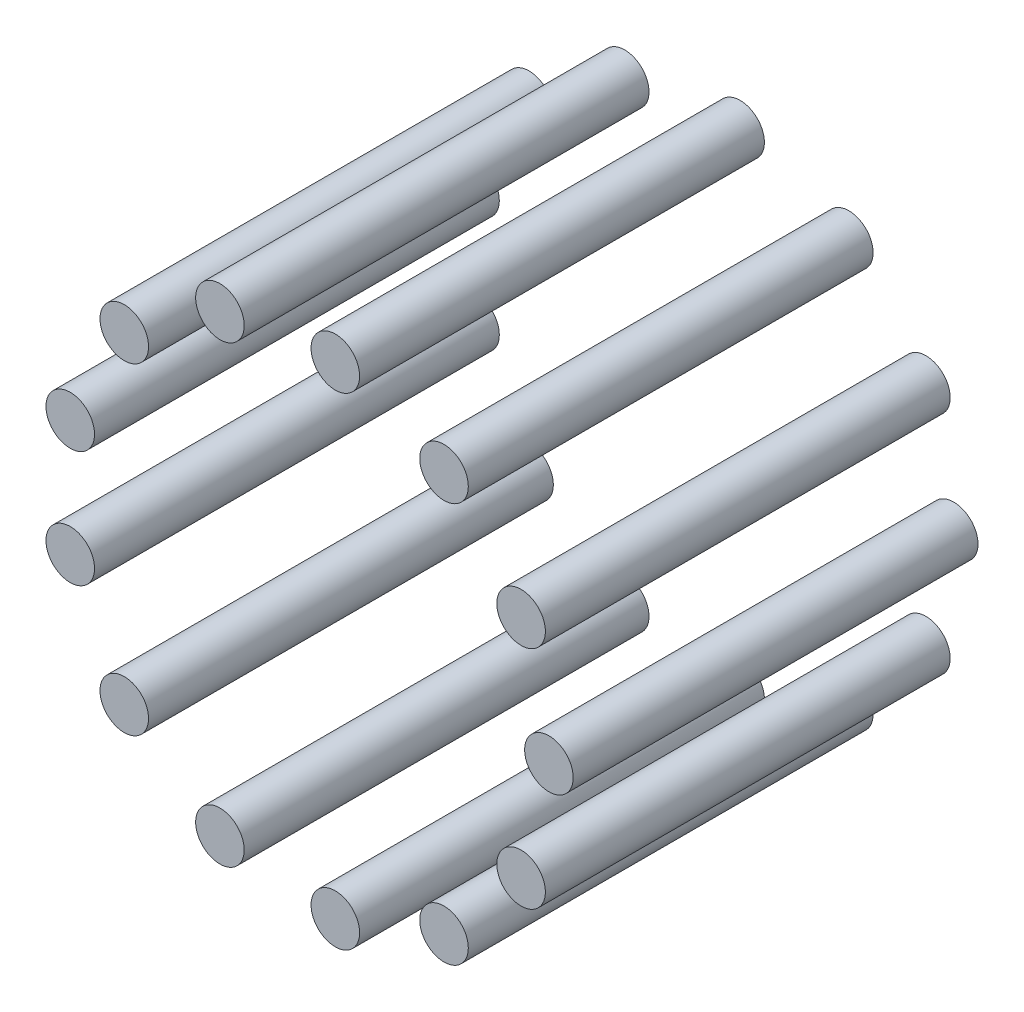
ISO-10303-21;
HEADER;
FILE_DESCRIPTION(('STEP AP214'),'2;1');
FILE_NAME('part.step','',(''),(''),'','','');
FILE_SCHEMA(('AUTOMOTIVE_DESIGN { 1 0 10303 214 1 1 1 1 }'));
ENDSEC;
DATA;
#1=APPLICATION_CONTEXT('core data for automotive mechanical design processes');
#2=APPLICATION_PROTOCOL_DEFINITION('international standard','automotive_design',2000,#1);
#3=PRODUCT_CONTEXT('',#1,'mechanical');
#4=PRODUCT('Part','Part','',(#3));
#5=PRODUCT_RELATED_PRODUCT_CATEGORY('part','',(#4));
#6=PRODUCT_DEFINITION_FORMATION('','',#4);
#7=PRODUCT_DEFINITION_CONTEXT('part definition',#1,'design');
#8=PRODUCT_DEFINITION('design','',#6,#7);
#9=PRODUCT_DEFINITION_SHAPE('','',#8);
#10=(LENGTH_UNIT() NAMED_UNIT(*) SI_UNIT(.MILLI.,.METRE.));
#11=(NAMED_UNIT(*) PLANE_ANGLE_UNIT() SI_UNIT($,.RADIAN.));
#12=(NAMED_UNIT(*) SI_UNIT($,.STERADIAN.) SOLID_ANGLE_UNIT());
#13=UNCERTAINTY_MEASURE_WITH_UNIT(LENGTH_MEASURE(1.E-05),#10,'distance_accuracy_value','');
#14=(GEOMETRIC_REPRESENTATION_CONTEXT(3) GLOBAL_UNCERTAINTY_ASSIGNED_CONTEXT((#13)) GLOBAL_UNIT_ASSIGNED_CONTEXT((#10,
#11,#12)) REPRESENTATION_CONTEXT('',''));
#15=CARTESIAN_POINT('',(0.,0.,0.));
#16=DIRECTION('',(0.,0.,1.));
#17=DIRECTION('',(1.,0.,0.));
#18=AXIS2_PLACEMENT_3D('',#15,#16,#17);
#19=CARTESIAN_POINT('',(26.5636807695963,13.9416951613131,50.));
#20=DIRECTION('',(0.,0.,-1.));
#21=DIRECTION('',(-1.,0.,0.));
#22=AXIS2_PLACEMENT_3D('',#19,#20,#21);
#23=CYLINDRICAL_SURFACE('',#22,3.);
#24=CARTESIAN_POINT('',(26.5636807695963,13.9416951613131,50.));
#25=DIRECTION('',(0.,0.,1.));
#26=DIRECTION('',(1.,0.,0.));
#27=AXIS2_PLACEMENT_3D('',#24,#25,#26);
#28=CIRCLE('',#27,3.);
#29=CARTESIAN_POINT('',(29.5636807695963,13.9416951613131,50.));
#30=VERTEX_POINT('',#29);
#31=EDGE_CURVE('E56',#30,#30,#28,.T.);
#32=ORIENTED_EDGE('',*,*,#31,.F.);
#33=EDGE_LOOP('',(#32));
#34=FACE_BOUND('',#33,.T.);
#35=CARTESIAN_POINT('',(26.5636807695963,13.9416951613131,0.));
#36=DIRECTION('',(0.,0.,1.));
#37=DIRECTION('',(1.,0.,0.));
#38=AXIS2_PLACEMENT_3D('',#35,#36,#37);
#39=CIRCLE('',#38,3.);
#40=CARTESIAN_POINT('',(29.5636807695963,13.9416951613131,0.));
#41=VERTEX_POINT('',#40);
#42=EDGE_CURVE('E11',#41,#41,#39,.T.);
#43=ORIENTED_EDGE('',*,*,#42,.T.);
#44=EDGE_LOOP('',(#43));
#45=FACE_BOUND('',#44,.T.);
#46=ADVANCED_FACE('F52',(#34,#45),#23,.T.);
#47=CARTESIAN_POINT('',(26.5636807695963,13.9416951613131,50.));
#48=DIRECTION('',(0.,0.,1.));
#49=DIRECTION('',(1.,0.,0.));
#50=AXIS2_PLACEMENT_3D('',#47,#48,#49);
#51=PLANE('',#50);
#52=ORIENTED_EDGE('',*,*,#31,.T.);
#53=EDGE_LOOP('',(#52));
#54=FACE_BOUND('',#53,.T.);
#55=ADVANCED_FACE('F54',(#54),#51,.T.);
#56=CARTESIAN_POINT('',(26.5636807695963,13.9416951613131,0.));
#57=DIRECTION('',(0.,0.,1.));
#58=DIRECTION('',(1.,0.,0.));
#59=AXIS2_PLACEMENT_3D('',#56,#57,#58);
#60=PLANE('',#59);
#61=ORIENTED_EDGE('',*,*,#42,.F.);
#62=EDGE_LOOP('',(#61));
#63=FACE_BOUND('',#62,.T.);
#64=ADVANCED_FACE('F71',(#63),#60,.F.);
#65=CLOSED_SHELL('',(#46,#55,#64));
#66=MANIFOLD_SOLID_BREP('B2',#65);
#67=CARTESIAN_POINT('',(17.0419424019347,24.6895159768097,50.));
#68=DIRECTION('',(0.,0.,-1.));
#69=DIRECTION('',(-1.,0.,0.));
#70=AXIS2_PLACEMENT_3D('',#67,#68,#69);
#71=CYLINDRICAL_SURFACE('',#70,3.);
#72=CARTESIAN_POINT('',(17.0419424019347,24.6895159768097,50.));
#73=DIRECTION('',(0.,0.,1.));
#74=DIRECTION('',(1.,0.,0.));
#75=AXIS2_PLACEMENT_3D('',#72,#73,#74);
#76=CIRCLE('',#75,3.);
#77=CARTESIAN_POINT('',(20.0419424019347,24.6895159768097,50.));
#78=VERTEX_POINT('',#77);
#79=EDGE_CURVE('E105',#78,#78,#76,.T.);
#80=ORIENTED_EDGE('',*,*,#79,.F.);
#81=EDGE_LOOP('',(#80));
#82=FACE_BOUND('',#81,.T.);
#83=CARTESIAN_POINT('',(17.0419424019347,24.6895159768097,0.));
#84=DIRECTION('',(0.,0.,1.));
#85=DIRECTION('',(1.,0.,0.));
#86=AXIS2_PLACEMENT_3D('',#83,#84,#85);
#87=CIRCLE('',#86,3.);
#88=CARTESIAN_POINT('',(20.0419424019347,24.6895159768097,0.));
#89=VERTEX_POINT('',#88);
#90=EDGE_CURVE('E51',#89,#89,#87,.T.);
#91=ORIENTED_EDGE('',*,*,#90,.T.);
#92=EDGE_LOOP('',(#91));
#93=FACE_BOUND('',#92,.T.);
#94=ADVANCED_FACE('F101',(#82,#93),#71,.T.);
#95=CARTESIAN_POINT('',(17.0419424019347,24.6895159768097,50.));
#96=DIRECTION('',(0.,0.,1.));
#97=DIRECTION('',(1.,0.,0.));
#98=AXIS2_PLACEMENT_3D('',#95,#96,#97);
#99=PLANE('',#98);
#100=ORIENTED_EDGE('',*,*,#79,.T.);
#101=EDGE_LOOP('',(#100));
#102=FACE_BOUND('',#101,.T.);
#103=ADVANCED_FACE('F103',(#102),#99,.T.);
#104=CARTESIAN_POINT('',(17.0419424019347,24.6895159768097,0.));
#105=DIRECTION('',(0.,0.,1.));
#106=DIRECTION('',(1.,0.,0.));
#107=AXIS2_PLACEMENT_3D('',#104,#105,#106);
#108=PLANE('',#107);
#109=ORIENTED_EDGE('',*,*,#90,.F.);
#110=EDGE_LOOP('',(#109));
#111=FACE_BOUND('',#110,.T.);
#112=ADVANCED_FACE('F120',(#111),#108,.F.);
#113=CLOSED_SHELL('',(#94,#103,#112));
#114=MANIFOLD_SOLID_BREP('B6',#113);
#115=CARTESIAN_POINT('',(3.61610040765973,29.7812662229416,50.));
#116=DIRECTION('',(0.,0.,-1.));
#117=DIRECTION('',(-1.,0.,0.));
#118=AXIS2_PLACEMENT_3D('',#115,#116,#117);
#119=CYLINDRICAL_SURFACE('',#118,3.);
#120=CARTESIAN_POINT('',(3.61610040765973,29.7812662229416,50.));
#121=DIRECTION('',(0.,0.,1.));
#122=DIRECTION('',(1.,0.,0.));
#123=AXIS2_PLACEMENT_3D('',#120,#121,#122);
#124=CIRCLE('',#123,3.);
#125=CARTESIAN_POINT('',(6.61610040765973,29.7812662229416,50.));
#126=VERTEX_POINT('',#125);
#127=EDGE_CURVE('E154',#126,#126,#124,.T.);
#128=ORIENTED_EDGE('',*,*,#127,.F.);
#129=EDGE_LOOP('',(#128));
#130=FACE_BOUND('',#129,.T.);
#131=CARTESIAN_POINT('',(3.61610040765973,29.7812662229416,0.));
#132=DIRECTION('',(0.,0.,1.));
#133=DIRECTION('',(1.,0.,0.));
#134=AXIS2_PLACEMENT_3D('',#131,#132,#133);
#135=CIRCLE('',#134,3.);
#136=CARTESIAN_POINT('',(6.61610040765973,29.7812662229416,0.));
#137=VERTEX_POINT('',#136);
#138=EDGE_CURVE('E100',#137,#137,#135,.T.);
#139=ORIENTED_EDGE('',*,*,#138,.T.);
#140=EDGE_LOOP('',(#139));
#141=FACE_BOUND('',#140,.T.);
#142=ADVANCED_FACE('F150',(#130,#141),#119,.T.);
#143=CARTESIAN_POINT('',(3.61610040765973,29.7812662229416,50.));
#144=DIRECTION('',(0.,0.,1.));
#145=DIRECTION('',(1.,0.,0.));
#146=AXIS2_PLACEMENT_3D('',#143,#144,#145);
#147=PLANE('',#146);
#148=ORIENTED_EDGE('',*,*,#127,.T.);
#149=EDGE_LOOP('',(#148));
#150=FACE_BOUND('',#149,.T.);
#151=ADVANCED_FACE('F152',(#150),#147,.T.);
#152=CARTESIAN_POINT('',(3.61610040765973,29.7812662229416,0.));
#153=DIRECTION('',(0.,0.,1.));
#154=DIRECTION('',(1.,0.,0.));
#155=AXIS2_PLACEMENT_3D('',#152,#153,#154);
#156=PLANE('',#155);
#157=ORIENTED_EDGE('',*,*,#138,.F.);
#158=EDGE_LOOP('',(#157));
#159=FACE_BOUND('',#158,.T.);
#160=ADVANCED_FACE('F169',(#159),#156,.F.);
#161=CLOSED_SHELL('',(#142,#151,#160));
#162=MANIFOLD_SOLID_BREP('B46',#161);
#163=CARTESIAN_POINT('',(-10.638146611276,28.0504872805624,50.));
#164=DIRECTION('',(0.,0.,-1.));
#165=DIRECTION('',(-1.,0.,0.));
#166=AXIS2_PLACEMENT_3D('',#163,#164,#165);
#167=CYLINDRICAL_SURFACE('',#166,3.);
#168=CARTESIAN_POINT('',(-10.638146611276,28.0504872805624,50.));
#169=DIRECTION('',(0.,0.,1.));
#170=DIRECTION('',(1.,0.,0.));
#171=AXIS2_PLACEMENT_3D('',#168,#169,#170);
#172=CIRCLE('',#171,3.);
#173=CARTESIAN_POINT('',(-7.638146611276,28.0504872805624,50.));
#174=VERTEX_POINT('',#173);
#175=EDGE_CURVE('E203',#174,#174,#172,.T.);
#176=ORIENTED_EDGE('',*,*,#175,.F.);
#177=EDGE_LOOP('',(#176));
#178=FACE_BOUND('',#177,.T.);
#179=CARTESIAN_POINT('',(-10.638146611276,28.0504872805624,0.));
#180=DIRECTION('',(0.,0.,1.));
#181=DIRECTION('',(1.,0.,0.));
#182=AXIS2_PLACEMENT_3D('',#179,#180,#181);
#183=CIRCLE('',#182,3.);
#184=CARTESIAN_POINT('',(-7.638146611276,28.0504872805624,0.));
#185=VERTEX_POINT('',#184);
#186=EDGE_CURVE('E149',#185,#185,#183,.T.);
#187=ORIENTED_EDGE('',*,*,#186,.T.);
#188=EDGE_LOOP('',(#187));
#189=FACE_BOUND('',#188,.T.);
#190=ADVANCED_FACE('F199',(#178,#189),#167,.T.);
#191=CARTESIAN_POINT('',(-10.638146611276,28.0504872805624,50.));
#192=DIRECTION('',(0.,0.,1.));
#193=DIRECTION('',(1.,0.,0.));
#194=AXIS2_PLACEMENT_3D('',#191,#192,#193);
#195=PLANE('',#194);
#196=ORIENTED_EDGE('',*,*,#175,.T.);
#197=EDGE_LOOP('',(#196));
#198=FACE_BOUND('',#197,.T.);
#199=ADVANCED_FACE('F201',(#198),#195,.T.);
#200=CARTESIAN_POINT('',(-10.638146611276,28.0504872805624,0.));
#201=DIRECTION('',(0.,0.,1.));
#202=DIRECTION('',(1.,0.,0.));
#203=AXIS2_PLACEMENT_3D('',#200,#201,#202);
#204=PLANE('',#203);
#205=ORIENTED_EDGE('',*,*,#186,.F.);
#206=EDGE_LOOP('',(#205));
#207=FACE_BOUND('',#206,.T.);
#208=ADVANCED_FACE('F218',(#207),#204,.F.);
#209=CLOSED_SHELL('',(#190,#199,#208));
#210=MANIFOLD_SOLID_BREP('B95',#209);
#211=CARTESIAN_POINT('',(-22.4553224451329,19.8936797472238,50.));
#212=DIRECTION('',(0.,0.,-1.));
#213=DIRECTION('',(-1.,0.,0.));
#214=AXIS2_PLACEMENT_3D('',#211,#212,#213);
#215=CYLINDRICAL_SURFACE('',#214,3.);
#216=CARTESIAN_POINT('',(-22.4553224451329,19.8936797472238,50.));
#217=DIRECTION('',(0.,0.,1.));
#218=DIRECTION('',(1.,0.,0.));
#219=AXIS2_PLACEMENT_3D('',#216,#217,#218);
#220=CIRCLE('',#219,3.);
#221=CARTESIAN_POINT('',(-19.4553224451329,19.8936797472238,50.));
#222=VERTEX_POINT('',#221);
#223=EDGE_CURVE('E252',#222,#222,#220,.T.);
#224=ORIENTED_EDGE('',*,*,#223,.F.);
#225=EDGE_LOOP('',(#224));
#226=FACE_BOUND('',#225,.T.);
#227=CARTESIAN_POINT('',(-22.4553224451329,19.8936797472238,0.));
#228=DIRECTION('',(0.,0.,1.));
#229=DIRECTION('',(1.,0.,0.));
#230=AXIS2_PLACEMENT_3D('',#227,#228,#229);
#231=CIRCLE('',#230,3.);
#232=CARTESIAN_POINT('',(-19.4553224451329,19.8936797472238,0.));
#233=VERTEX_POINT('',#232);
#234=EDGE_CURVE('E198',#233,#233,#231,.T.);
#235=ORIENTED_EDGE('',*,*,#234,.T.);
#236=EDGE_LOOP('',(#235));
#237=FACE_BOUND('',#236,.T.);
#238=ADVANCED_FACE('F248',(#226,#237),#215,.T.);
#239=CARTESIAN_POINT('',(-22.4553224451329,19.8936797472238,50.));
#240=DIRECTION('',(0.,0.,1.));
#241=DIRECTION('',(1.,0.,0.));
#242=AXIS2_PLACEMENT_3D('',#239,#240,#241);
#243=PLANE('',#242);
#244=ORIENTED_EDGE('',*,*,#223,.T.);
#245=EDGE_LOOP('',(#244));
#246=FACE_BOUND('',#245,.T.);
#247=ADVANCED_FACE('F250',(#246),#243,.T.);
#248=CARTESIAN_POINT('',(-22.4553224451329,19.8936797472238,0.));
#249=DIRECTION('',(0.,0.,1.));
#250=DIRECTION('',(1.,0.,0.));
#251=AXIS2_PLACEMENT_3D('',#248,#249,#250);
#252=PLANE('',#251);
#253=ORIENTED_EDGE('',*,*,#234,.F.);
#254=EDGE_LOOP('',(#253));
#255=FACE_BOUND('',#254,.T.);
#256=ADVANCED_FACE('F267',(#255),#252,.F.);
#257=CLOSED_SHELL('',(#238,#247,#256));
#258=MANIFOLD_SOLID_BREP('B144',#257);
#259=CARTESIAN_POINT('',(-29.1282545227815,7.17946992862675,50.));
#260=DIRECTION('',(0.,0.,-1.));
#261=DIRECTION('',(-1.,0.,0.));
#262=AXIS2_PLACEMENT_3D('',#259,#260,#261);
#263=CYLINDRICAL_SURFACE('',#262,3.);
#264=CARTESIAN_POINT('',(-29.1282545227815,7.17946992862675,50.));
#265=DIRECTION('',(0.,0.,1.));
#266=DIRECTION('',(1.,0.,0.));
#267=AXIS2_PLACEMENT_3D('',#264,#265,#266);
#268=CIRCLE('',#267,3.);
#269=CARTESIAN_POINT('',(-26.1282545227815,7.17946992862675,50.));
#270=VERTEX_POINT('',#269);
#271=EDGE_CURVE('E301',#270,#270,#268,.T.);
#272=ORIENTED_EDGE('',*,*,#271,.F.);
#273=EDGE_LOOP('',(#272));
#274=FACE_BOUND('',#273,.T.);
#275=CARTESIAN_POINT('',(-29.1282545227815,7.17946992862675,0.));
#276=DIRECTION('',(0.,0.,1.));
#277=DIRECTION('',(1.,0.,0.));
#278=AXIS2_PLACEMENT_3D('',#275,#276,#277);
#279=CIRCLE('',#278,3.);
#280=CARTESIAN_POINT('',(-26.1282545227815,7.17946992862675,0.));
#281=VERTEX_POINT('',#280);
#282=EDGE_CURVE('E247',#281,#281,#279,.T.);
#283=ORIENTED_EDGE('',*,*,#282,.T.);
#284=EDGE_LOOP('',(#283));
#285=FACE_BOUND('',#284,.T.);
#286=ADVANCED_FACE('F297',(#274,#285),#263,.T.);
#287=CARTESIAN_POINT('',(-29.1282545227815,7.17946992862675,50.));
#288=DIRECTION('',(0.,0.,1.));
#289=DIRECTION('',(1.,0.,0.));
#290=AXIS2_PLACEMENT_3D('',#287,#288,#289);
#291=PLANE('',#290);
#292=ORIENTED_EDGE('',*,*,#271,.T.);
#293=EDGE_LOOP('',(#292));
#294=FACE_BOUND('',#293,.T.);
#295=ADVANCED_FACE('F299',(#294),#291,.T.);
#296=CARTESIAN_POINT('',(-29.1282545227815,7.17946992862675,0.));
#297=DIRECTION('',(0.,0.,1.));
#298=DIRECTION('',(1.,0.,0.));
#299=AXIS2_PLACEMENT_3D('',#296,#297,#298);
#300=PLANE('',#299);
#301=ORIENTED_EDGE('',*,*,#282,.F.);
#302=EDGE_LOOP('',(#301));
#303=FACE_BOUND('',#302,.T.);
#304=ADVANCED_FACE('F316',(#303),#300,.F.);
#305=CLOSED_SHELL('',(#286,#295,#304));
#306=MANIFOLD_SOLID_BREP('B193',#305);
#307=CARTESIAN_POINT('',(-29.1282545227815,-7.1794699286267,50.));
#308=DIRECTION('',(0.,0.,-1.));
#309=DIRECTION('',(-1.,0.,0.));
#310=AXIS2_PLACEMENT_3D('',#307,#308,#309);
#311=CYLINDRICAL_SURFACE('',#310,3.);
#312=CARTESIAN_POINT('',(-29.1282545227815,-7.1794699286267,50.));
#313=DIRECTION('',(0.,0.,1.));
#314=DIRECTION('',(1.,0.,0.));
#315=AXIS2_PLACEMENT_3D('',#312,#313,#314);
#316=CIRCLE('',#315,3.);
#317=CARTESIAN_POINT('',(-26.1282545227815,-7.1794699286267,50.));
#318=VERTEX_POINT('',#317);
#319=EDGE_CURVE('E350',#318,#318,#316,.T.);
#320=ORIENTED_EDGE('',*,*,#319,.F.);
#321=EDGE_LOOP('',(#320));
#322=FACE_BOUND('',#321,.T.);
#323=CARTESIAN_POINT('',(-29.1282545227815,-7.1794699286267,0.));
#324=DIRECTION('',(0.,0.,1.));
#325=DIRECTION('',(1.,0.,0.));
#326=AXIS2_PLACEMENT_3D('',#323,#324,#325);
#327=CIRCLE('',#326,3.);
#328=CARTESIAN_POINT('',(-26.1282545227815,-7.1794699286267,0.));
#329=VERTEX_POINT('',#328);
#330=EDGE_CURVE('E296',#329,#329,#327,.T.);
#331=ORIENTED_EDGE('',*,*,#330,.T.);
#332=EDGE_LOOP('',(#331));
#333=FACE_BOUND('',#332,.T.);
#334=ADVANCED_FACE('F346',(#322,#333),#311,.T.);
#335=CARTESIAN_POINT('',(-29.1282545227815,-7.1794699286267,50.));
#336=DIRECTION('',(0.,0.,1.));
#337=DIRECTION('',(1.,0.,0.));
#338=AXIS2_PLACEMENT_3D('',#335,#336,#337);
#339=PLANE('',#338);
#340=ORIENTED_EDGE('',*,*,#319,.T.);
#341=EDGE_LOOP('',(#340));
#342=FACE_BOUND('',#341,.T.);
#343=ADVANCED_FACE('F348',(#342),#339,.T.);
#344=CARTESIAN_POINT('',(-29.1282545227815,-7.1794699286267,0.));
#345=DIRECTION('',(0.,0.,1.));
#346=DIRECTION('',(1.,0.,0.));
#347=AXIS2_PLACEMENT_3D('',#344,#345,#346);
#348=PLANE('',#347);
#349=ORIENTED_EDGE('',*,*,#330,.F.);
#350=EDGE_LOOP('',(#349));
#351=FACE_BOUND('',#350,.T.);
#352=ADVANCED_FACE('F365',(#351),#348,.F.);
#353=CLOSED_SHELL('',(#334,#343,#352));
#354=MANIFOLD_SOLID_BREP('B242',#353);
#355=CARTESIAN_POINT('',(-22.455322445133,-19.8936797472238,50.));
#356=DIRECTION('',(0.,0.,-1.));
#357=DIRECTION('',(-1.,0.,0.));
#358=AXIS2_PLACEMENT_3D('',#355,#356,#357);
#359=CYLINDRICAL_SURFACE('',#358,3.);
#360=CARTESIAN_POINT('',(-22.455322445133,-19.8936797472238,50.));
#361=DIRECTION('',(0.,0.,1.));
#362=DIRECTION('',(1.,0.,0.));
#363=AXIS2_PLACEMENT_3D('',#360,#361,#362);
#364=CIRCLE('',#363,3.);
#365=CARTESIAN_POINT('',(-19.455322445133,-19.8936797472238,50.));
#366=VERTEX_POINT('',#365);
#367=EDGE_CURVE('E399',#366,#366,#364,.T.);
#368=ORIENTED_EDGE('',*,*,#367,.F.);
#369=EDGE_LOOP('',(#368));
#370=FACE_BOUND('',#369,.T.);
#371=CARTESIAN_POINT('',(-22.455322445133,-19.8936797472238,0.));
#372=DIRECTION('',(0.,0.,1.));
#373=DIRECTION('',(1.,0.,0.));
#374=AXIS2_PLACEMENT_3D('',#371,#372,#373);
#375=CIRCLE('',#374,3.);
#376=CARTESIAN_POINT('',(-19.455322445133,-19.8936797472238,0.));
#377=VERTEX_POINT('',#376);
#378=EDGE_CURVE('E345',#377,#377,#375,.T.);
#379=ORIENTED_EDGE('',*,*,#378,.T.);
#380=EDGE_LOOP('',(#379));
#381=FACE_BOUND('',#380,.T.);
#382=ADVANCED_FACE('F395',(#370,#381),#359,.T.);
#383=CARTESIAN_POINT('',(-22.455322445133,-19.8936797472238,50.));
#384=DIRECTION('',(0.,0.,1.));
#385=DIRECTION('',(1.,0.,0.));
#386=AXIS2_PLACEMENT_3D('',#383,#384,#385);
#387=PLANE('',#386);
#388=ORIENTED_EDGE('',*,*,#367,.T.);
#389=EDGE_LOOP('',(#388));
#390=FACE_BOUND('',#389,.T.);
#391=ADVANCED_FACE('F397',(#390),#387,.T.);
#392=CARTESIAN_POINT('',(-22.455322445133,-19.8936797472238,0.));
#393=DIRECTION('',(0.,0.,1.));
#394=DIRECTION('',(1.,0.,0.));
#395=AXIS2_PLACEMENT_3D('',#392,#393,#394);
#396=PLANE('',#395);
#397=ORIENTED_EDGE('',*,*,#378,.F.);
#398=EDGE_LOOP('',(#397));
#399=FACE_BOUND('',#398,.T.);
#400=ADVANCED_FACE('F414',(#399),#396,.F.);
#401=CLOSED_SHELL('',(#382,#391,#400));
#402=MANIFOLD_SOLID_BREP('B291',#401);
#403=CARTESIAN_POINT('',(-10.638146611276,-28.0504872805624,50.));
#404=DIRECTION('',(0.,0.,-1.));
#405=DIRECTION('',(-1.,0.,0.));
#406=AXIS2_PLACEMENT_3D('',#403,#404,#405);
#407=CYLINDRICAL_SURFACE('',#406,3.);
#408=CARTESIAN_POINT('',(-10.638146611276,-28.0504872805624,50.));
#409=DIRECTION('',(0.,0.,1.));
#410=DIRECTION('',(1.,0.,0.));
#411=AXIS2_PLACEMENT_3D('',#408,#409,#410);
#412=CIRCLE('',#411,3.);
#413=CARTESIAN_POINT('',(-7.63814661127602,-28.0504872805624,50.));
#414=VERTEX_POINT('',#413);
#415=EDGE_CURVE('E448',#414,#414,#412,.T.);
#416=ORIENTED_EDGE('',*,*,#415,.F.);
#417=EDGE_LOOP('',(#416));
#418=FACE_BOUND('',#417,.T.);
#419=CARTESIAN_POINT('',(-10.638146611276,-28.0504872805624,0.));
#420=DIRECTION('',(0.,0.,1.));
#421=DIRECTION('',(1.,0.,0.));
#422=AXIS2_PLACEMENT_3D('',#419,#420,#421);
#423=CIRCLE('',#422,3.);
#424=CARTESIAN_POINT('',(-7.63814661127602,-28.0504872805624,0.));
#425=VERTEX_POINT('',#424);
#426=EDGE_CURVE('E394',#425,#425,#423,.T.);
#427=ORIENTED_EDGE('',*,*,#426,.T.);
#428=EDGE_LOOP('',(#427));
#429=FACE_BOUND('',#428,.T.);
#430=ADVANCED_FACE('F444',(#418,#429),#407,.T.);
#431=CARTESIAN_POINT('',(-10.638146611276,-28.0504872805624,50.));
#432=DIRECTION('',(0.,0.,1.));
#433=DIRECTION('',(1.,0.,0.));
#434=AXIS2_PLACEMENT_3D('',#431,#432,#433);
#435=PLANE('',#434);
#436=ORIENTED_EDGE('',*,*,#415,.T.);
#437=EDGE_LOOP('',(#436));
#438=FACE_BOUND('',#437,.T.);
#439=ADVANCED_FACE('F446',(#438),#435,.T.);
#440=CARTESIAN_POINT('',(-10.638146611276,-28.0504872805624,0.));
#441=DIRECTION('',(0.,0.,1.));
#442=DIRECTION('',(1.,0.,0.));
#443=AXIS2_PLACEMENT_3D('',#440,#441,#442);
#444=PLANE('',#443);
#445=ORIENTED_EDGE('',*,*,#426,.F.);
#446=EDGE_LOOP('',(#445));
#447=FACE_BOUND('',#446,.T.);
#448=ADVANCED_FACE('F463',(#447),#444,.F.);
#449=CLOSED_SHELL('',(#430,#439,#448));
#450=MANIFOLD_SOLID_BREP('B340',#449);
#451=CARTESIAN_POINT('',(3.61610040765972,-29.7812662229416,50.));
#452=DIRECTION('',(0.,0.,-1.));
#453=DIRECTION('',(-1.,0.,0.));
#454=AXIS2_PLACEMENT_3D('',#451,#452,#453);
#455=CYLINDRICAL_SURFACE('',#454,3.);
#456=CARTESIAN_POINT('',(3.61610040765972,-29.7812662229416,50.));
#457=DIRECTION('',(0.,0.,1.));
#458=DIRECTION('',(1.,0.,0.));
#459=AXIS2_PLACEMENT_3D('',#456,#457,#458);
#460=CIRCLE('',#459,3.);
#461=CARTESIAN_POINT('',(6.61610040765972,-29.7812662229416,50.));
#462=VERTEX_POINT('',#461);
#463=EDGE_CURVE('E497',#462,#462,#460,.T.);
#464=ORIENTED_EDGE('',*,*,#463,.F.);
#465=EDGE_LOOP('',(#464));
#466=FACE_BOUND('',#465,.T.);
#467=CARTESIAN_POINT('',(3.61610040765972,-29.7812662229416,0.));
#468=DIRECTION('',(0.,0.,1.));
#469=DIRECTION('',(1.,0.,0.));
#470=AXIS2_PLACEMENT_3D('',#467,#468,#469);
#471=CIRCLE('',#470,3.);
#472=CARTESIAN_POINT('',(6.61610040765972,-29.7812662229416,0.));
#473=VERTEX_POINT('',#472);
#474=EDGE_CURVE('E443',#473,#473,#471,.T.);
#475=ORIENTED_EDGE('',*,*,#474,.T.);
#476=EDGE_LOOP('',(#475));
#477=FACE_BOUND('',#476,.T.);
#478=ADVANCED_FACE('F493',(#466,#477),#455,.T.);
#479=CARTESIAN_POINT('',(3.61610040765972,-29.7812662229416,50.));
#480=DIRECTION('',(0.,0.,1.));
#481=DIRECTION('',(1.,0.,0.));
#482=AXIS2_PLACEMENT_3D('',#479,#480,#481);
#483=PLANE('',#482);
#484=ORIENTED_EDGE('',*,*,#463,.T.);
#485=EDGE_LOOP('',(#484));
#486=FACE_BOUND('',#485,.T.);
#487=ADVANCED_FACE('F495',(#486),#483,.T.);
#488=CARTESIAN_POINT('',(3.61610040765972,-29.7812662229416,0.));
#489=DIRECTION('',(0.,0.,1.));
#490=DIRECTION('',(1.,0.,0.));
#491=AXIS2_PLACEMENT_3D('',#488,#489,#490);
#492=PLANE('',#491);
#493=ORIENTED_EDGE('',*,*,#474,.F.);
#494=EDGE_LOOP('',(#493));
#495=FACE_BOUND('',#494,.T.);
#496=ADVANCED_FACE('F512',(#495),#492,.F.);
#497=CLOSED_SHELL('',(#478,#487,#496));
#498=MANIFOLD_SOLID_BREP('B389',#497);
#499=CARTESIAN_POINT('',(17.0419424019347,-24.6895159768096,50.));
#500=DIRECTION('',(0.,0.,-1.));
#501=DIRECTION('',(-1.,0.,0.));
#502=AXIS2_PLACEMENT_3D('',#499,#500,#501);
#503=CYLINDRICAL_SURFACE('',#502,3.);
#504=CARTESIAN_POINT('',(17.0419424019347,-24.6895159768096,50.));
#505=DIRECTION('',(0.,0.,1.));
#506=DIRECTION('',(1.,0.,0.));
#507=AXIS2_PLACEMENT_3D('',#504,#505,#506);
#508=CIRCLE('',#507,3.);
#509=CARTESIAN_POINT('',(20.0419424019347,-24.6895159768096,50.));
#510=VERTEX_POINT('',#509);
#511=EDGE_CURVE('E546',#510,#510,#508,.T.);
#512=ORIENTED_EDGE('',*,*,#511,.F.);
#513=EDGE_LOOP('',(#512));
#514=FACE_BOUND('',#513,.T.);
#515=CARTESIAN_POINT('',(17.0419424019347,-24.6895159768096,0.));
#516=DIRECTION('',(0.,0.,1.));
#517=DIRECTION('',(1.,0.,0.));
#518=AXIS2_PLACEMENT_3D('',#515,#516,#517);
#519=CIRCLE('',#518,3.);
#520=CARTESIAN_POINT('',(20.0419424019347,-24.6895159768096,0.));
#521=VERTEX_POINT('',#520);
#522=EDGE_CURVE('E492',#521,#521,#519,.T.);
#523=ORIENTED_EDGE('',*,*,#522,.T.);
#524=EDGE_LOOP('',(#523));
#525=FACE_BOUND('',#524,.T.);
#526=ADVANCED_FACE('F542',(#514,#525),#503,.T.);
#527=CARTESIAN_POINT('',(17.0419424019347,-24.6895159768096,50.));
#528=DIRECTION('',(0.,0.,1.));
#529=DIRECTION('',(1.,0.,0.));
#530=AXIS2_PLACEMENT_3D('',#527,#528,#529);
#531=PLANE('',#530);
#532=ORIENTED_EDGE('',*,*,#511,.T.);
#533=EDGE_LOOP('',(#532));
#534=FACE_BOUND('',#533,.T.);
#535=ADVANCED_FACE('F544',(#534),#531,.T.);
#536=CARTESIAN_POINT('',(17.0419424019347,-24.6895159768096,0.));
#537=DIRECTION('',(0.,0.,1.));
#538=DIRECTION('',(1.,0.,0.));
#539=AXIS2_PLACEMENT_3D('',#536,#537,#538);
#540=PLANE('',#539);
#541=ORIENTED_EDGE('',*,*,#522,.F.);
#542=EDGE_LOOP('',(#541));
#543=FACE_BOUND('',#542,.T.);
#544=ADVANCED_FACE('F561',(#543),#540,.F.);
#545=CLOSED_SHELL('',(#526,#535,#544));
#546=MANIFOLD_SOLID_BREP('B438',#545);
#547=CARTESIAN_POINT('',(26.5636807695963,-13.941695161313,50.));
#548=DIRECTION('',(0.,0.,-1.));
#549=DIRECTION('',(-1.,0.,0.));
#550=AXIS2_PLACEMENT_3D('',#547,#548,#549);
#551=CYLINDRICAL_SURFACE('',#550,3.);
#552=CARTESIAN_POINT('',(26.5636807695963,-13.941695161313,50.));
#553=DIRECTION('',(0.,0.,1.));
#554=DIRECTION('',(1.,0.,0.));
#555=AXIS2_PLACEMENT_3D('',#552,#553,#554);
#556=CIRCLE('',#555,3.);
#557=CARTESIAN_POINT('',(29.5636807695963,-13.941695161313,50.));
#558=VERTEX_POINT('',#557);
#559=EDGE_CURVE('E594',#558,#558,#556,.T.);
#560=ORIENTED_EDGE('',*,*,#559,.F.);
#561=EDGE_LOOP('',(#560));
#562=FACE_BOUND('',#561,.T.);
#563=CARTESIAN_POINT('',(26.5636807695963,-13.941695161313,0.));
#564=DIRECTION('',(0.,0.,1.));
#565=DIRECTION('',(1.,0.,0.));
#566=AXIS2_PLACEMENT_3D('',#563,#564,#565);
#567=CIRCLE('',#566,3.);
#568=CARTESIAN_POINT('',(29.5636807695963,-13.941695161313,0.));
#569=VERTEX_POINT('',#568);
#570=EDGE_CURVE('E541',#569,#569,#567,.T.);
#571=ORIENTED_EDGE('',*,*,#570,.T.);
#572=EDGE_LOOP('',(#571));
#573=FACE_BOUND('',#572,.T.);
#574=ADVANCED_FACE('F590',(#562,#573),#551,.T.);
#575=CARTESIAN_POINT('',(26.5636807695963,-13.941695161313,50.));
#576=DIRECTION('',(0.,0.,1.));
#577=DIRECTION('',(1.,0.,0.));
#578=AXIS2_PLACEMENT_3D('',#575,#576,#577);
#579=PLANE('',#578);
#580=ORIENTED_EDGE('',*,*,#559,.T.);
#581=EDGE_LOOP('',(#580));
#582=FACE_BOUND('',#581,.T.);
#583=ADVANCED_FACE('F592',(#582),#579,.T.);
#584=CARTESIAN_POINT('',(26.5636807695963,-13.941695161313,0.));
#585=DIRECTION('',(0.,0.,1.));
#586=DIRECTION('',(1.,0.,0.));
#587=AXIS2_PLACEMENT_3D('',#584,#585,#586);
#588=PLANE('',#587);
#589=ORIENTED_EDGE('',*,*,#570,.F.);
#590=EDGE_LOOP('',(#589));
#591=FACE_BOUND('',#590,.T.);
#592=ADVANCED_FACE('F611',(#591),#588,.F.);
#593=CLOSED_SHELL('',(#574,#583,#592));
#594=MANIFOLD_SOLID_BREP('B487',#593);
#595=CARTESIAN_POINT('',(30.,0.,50.));
#596=DIRECTION('',(0.,0.,-1.));
#597=DIRECTION('',(-1.,0.,0.));
#598=AXIS2_PLACEMENT_3D('',#595,#596,#597);
#599=CYLINDRICAL_SURFACE('',#598,3.);
#600=CARTESIAN_POINT('',(30.,0.,50.));
#601=DIRECTION('',(0.,0.,1.));
#602=DIRECTION('',(1.,0.,0.));
#603=AXIS2_PLACEMENT_3D('',#600,#601,#602);
#604=CIRCLE('',#603,3.);
#605=CARTESIAN_POINT('',(33.,0.,50.));
#606=VERTEX_POINT('',#605);
#607=EDGE_CURVE('E589',#606,#606,#604,.T.);
#608=ORIENTED_EDGE('',*,*,#607,.F.);
#609=EDGE_LOOP('',(#608));
#610=FACE_BOUND('',#609,.T.);
#611=CARTESIAN_POINT('',(30.,0.,0.));
#612=DIRECTION('',(0.,0.,1.));
#613=DIRECTION('',(1.,0.,0.));
#614=AXIS2_PLACEMENT_3D('',#611,#612,#613);
#615=CIRCLE('',#614,3.);
#616=CARTESIAN_POINT('',(33.,0.,0.));
#617=VERTEX_POINT('',#616);
#618=EDGE_CURVE('E636',#617,#617,#615,.T.);
#619=ORIENTED_EDGE('',*,*,#618,.T.);
#620=EDGE_LOOP('',(#619));
#621=FACE_BOUND('',#620,.T.);
#622=ADVANCED_FACE('F633',(#610,#621),#599,.T.);
#623=CARTESIAN_POINT('',(30.,0.,50.));
#624=DIRECTION('',(0.,0.,1.));
#625=DIRECTION('',(1.,0.,0.));
#626=AXIS2_PLACEMENT_3D('',#623,#624,#625);
#627=PLANE('',#626);
#628=ORIENTED_EDGE('',*,*,#607,.T.);
#629=EDGE_LOOP('',(#628));
#630=FACE_BOUND('',#629,.T.);
#631=ADVANCED_FACE('F648',(#630),#627,.T.);
#632=CARTESIAN_POINT('',(30.,0.,0.));
#633=DIRECTION('',(0.,0.,1.));
#634=DIRECTION('',(1.,0.,0.));
#635=AXIS2_PLACEMENT_3D('',#632,#633,#634);
#636=PLANE('',#635);
#637=ORIENTED_EDGE('',*,*,#618,.F.);
#638=EDGE_LOOP('',(#637));
#639=FACE_BOUND('',#638,.T.);
#640=ADVANCED_FACE('F646',(#639),#636,.F.);
#641=CLOSED_SHELL('',(#622,#631,#640));
#642=MANIFOLD_SOLID_BREP('B536',#641);
#643=ADVANCED_BREP_SHAPE_REPRESENTATION('',(#18,#66,#114,#162,#210,#258,#306,#354,#402,#450,
#498,#546,#594,#642),#14);
#644=SHAPE_DEFINITION_REPRESENTATION(#9,#643);
ENDSEC;
END-ISO-10303-21;
